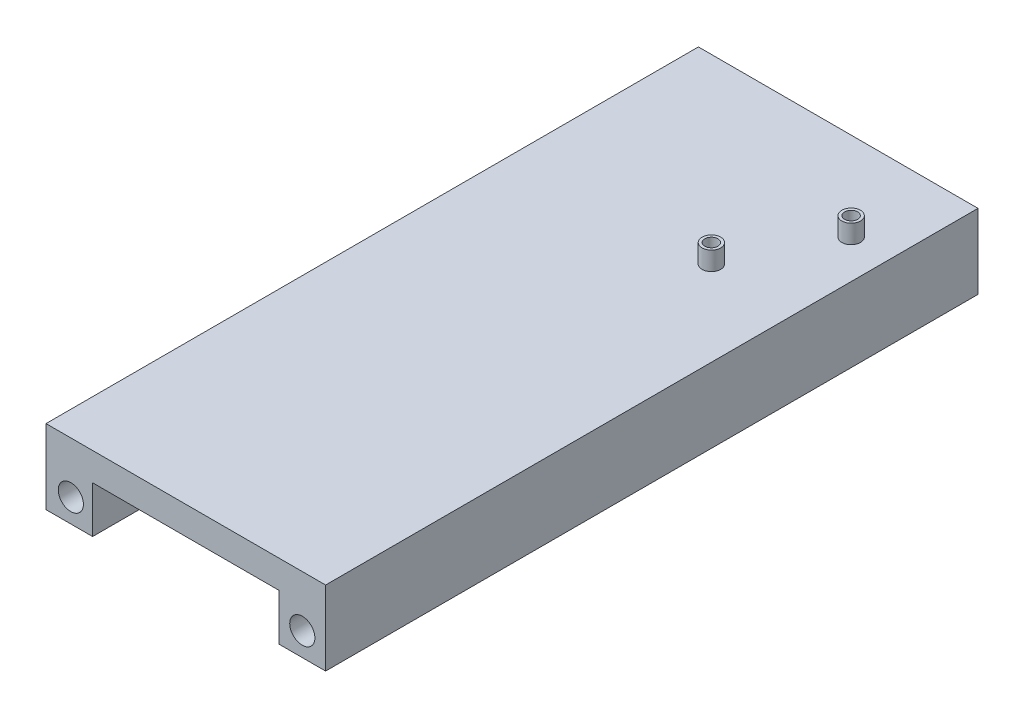
ISO-10303-21;
HEADER;
FILE_DESCRIPTION(('STEP AP214'),'2;1');
FILE_NAME('part.step','',(''),(''),'','','');
FILE_SCHEMA(('AUTOMOTIVE_DESIGN { 1 0 10303 214 1 1 1 1 }'));
ENDSEC;
DATA;
#1=APPLICATION_CONTEXT('core data for automotive mechanical design processes');
#2=APPLICATION_PROTOCOL_DEFINITION('international standard','automotive_design',2000,#1);
#3=PRODUCT_CONTEXT('',#1,'mechanical');
#4=PRODUCT('Part','Part','',(#3));
#5=PRODUCT_RELATED_PRODUCT_CATEGORY('part','',(#4));
#6=PRODUCT_DEFINITION_FORMATION('','',#4);
#7=PRODUCT_DEFINITION_CONTEXT('part definition',#1,'design');
#8=PRODUCT_DEFINITION('design','',#6,#7);
#9=PRODUCT_DEFINITION_SHAPE('','',#8);
#10=(LENGTH_UNIT() NAMED_UNIT(*) SI_UNIT(.MILLI.,.METRE.));
#11=(NAMED_UNIT(*) PLANE_ANGLE_UNIT() SI_UNIT($,.RADIAN.));
#12=(NAMED_UNIT(*) SI_UNIT($,.STERADIAN.) SOLID_ANGLE_UNIT());
#13=UNCERTAINTY_MEASURE_WITH_UNIT(LENGTH_MEASURE(1.E-05),#10,'distance_accuracy_value','');
#14=(GEOMETRIC_REPRESENTATION_CONTEXT(3) GLOBAL_UNCERTAINTY_ASSIGNED_CONTEXT((#13)) GLOBAL_UNIT_ASSIGNED_CONTEXT((#10,
#11,#12)) REPRESENTATION_CONTEXT('',''));
#15=CARTESIAN_POINT('',(0.,0.,0.));
#16=DIRECTION('',(0.,0.,1.));
#17=DIRECTION('',(1.,0.,0.));
#18=AXIS2_PLACEMENT_3D('',#15,#16,#17);
#19=CARTESIAN_POINT('',(0.,0.,0.));
#20=DIRECTION('',(0.,-1.,0.));
#21=DIRECTION('',(0.,0.,-1.));
#22=AXIS2_PLACEMENT_3D('',#19,#20,#21);
#23=PLANE('',#22);
#24=DIRECTION('',(-1.,0.,0.));
#25=VECTOR('',#24,1.);
#26=CARTESIAN_POINT('',(0.,0.,-177.8));
#27=LINE('',#26,#25);
#28=CARTESIAN_POINT('',(63.5,0.,-177.8));
#29=VERTEX_POINT('',#28);
#30=CARTESIAN_POINT('',(12.7,0.,-177.8));
#31=VERTEX_POINT('',#30);
#32=EDGE_CURVE('E57',#29,#31,#27,.T.);
#33=ORIENTED_EDGE('',*,*,#32,.F.);
#34=DIRECTION('',(0.,0.,-1.));
#35=VECTOR('',#34,1.);
#36=CARTESIAN_POINT('',(63.5,0.,0.));
#37=LINE('',#36,#35);
#38=CARTESIAN_POINT('',(63.5,0.,0.));
#39=VERTEX_POINT('',#38);
#40=EDGE_CURVE('E106',#39,#29,#37,.T.);
#41=ORIENTED_EDGE('',*,*,#40,.F.);
#42=DIRECTION('',(1.,0.,0.));
#43=VECTOR('',#42,1.);
#44=CARTESIAN_POINT('',(0.,0.,0.));
#45=LINE('',#44,#43);
#46=CARTESIAN_POINT('',(12.7,0.,0.));
#47=VERTEX_POINT('',#46);
#48=EDGE_CURVE('E114',#47,#39,#45,.T.);
#49=ORIENTED_EDGE('',*,*,#48,.F.);
#50=DIRECTION('',(0.,0.,1.));
#51=VECTOR('',#50,1.);
#52=CARTESIAN_POINT('',(12.7,0.,0.));
#53=LINE('',#52,#51);
#54=EDGE_CURVE('E116',#31,#47,#53,.T.);
#55=ORIENTED_EDGE('',*,*,#54,.F.);
#56=EDGE_LOOP('',(#33,#41,#49,#55));
#57=FACE_BOUND('',#56,.T.);
#58=ADVANCED_FACE('F37',(#57),#23,.T.);
#59=CARTESIAN_POINT('',(0.,7.62,0.));
#60=DIRECTION('',(1.,0.,0.));
#61=DIRECTION('',(0.,0.,-1.));
#62=AXIS2_PLACEMENT_3D('',#59,#60,#61);
#63=PLANE('',#62);
#64=DIRECTION('',(0.,-1.,0.));
#65=VECTOR('',#64,1.);
#66=CARTESIAN_POINT('',(0.,7.62,-177.8));
#67=LINE('',#66,#65);
#68=CARTESIAN_POINT('',(0.,7.62,-177.8));
#69=VERTEX_POINT('',#68);
#70=CARTESIAN_POINT('',(0.,-12.7,-177.8));
#71=VERTEX_POINT('',#70);
#72=EDGE_CURVE('E134',#69,#71,#67,.T.);
#73=ORIENTED_EDGE('',*,*,#72,.T.);
#74=DIRECTION('',(0.,0.,-1.));
#75=VECTOR('',#74,1.);
#76=CARTESIAN_POINT('',(0.,-12.7,0.));
#77=LINE('',#76,#75);
#78=CARTESIAN_POINT('',(0.,-12.7,0.));
#79=VERTEX_POINT('',#78);
#80=EDGE_CURVE('E166',#79,#71,#77,.T.);
#81=ORIENTED_EDGE('',*,*,#80,.F.);
#82=DIRECTION('',(0.,-1.,0.));
#83=VECTOR('',#82,1.);
#84=CARTESIAN_POINT('',(0.,7.62,0.));
#85=LINE('',#84,#83);
#86=CARTESIAN_POINT('',(0.,7.62,0.));
#87=VERTEX_POINT('',#86);
#88=EDGE_CURVE('E140',#87,#79,#85,.T.);
#89=ORIENTED_EDGE('',*,*,#88,.F.);
#90=DIRECTION('',(0.,0.,1.));
#91=VECTOR('',#90,1.);
#92=CARTESIAN_POINT('',(0.,7.62,0.));
#93=LINE('',#92,#91);
#94=EDGE_CURVE('E126',#69,#87,#93,.T.);
#95=ORIENTED_EDGE('',*,*,#94,.F.);
#96=EDGE_LOOP('',(#73,#81,#89,#95));
#97=FACE_BOUND('',#96,.T.);
#98=ADVANCED_FACE('F39',(#97),#63,.F.);
#99=CARTESIAN_POINT('',(0.,7.62,0.));
#100=DIRECTION('',(0.,0.,-1.));
#101=DIRECTION('',(-1.,0.,0.));
#102=AXIS2_PLACEMENT_3D('',#99,#100,#101);
#103=PLANE('',#102);
#104=CARTESIAN_POINT('',(69.8500000000001,-6.35,0.));
#105=DIRECTION('',(0.,0.,-1.));
#106=DIRECTION('',(-1.,0.,0.));
#107=AXIS2_PLACEMENT_3D('',#104,#105,#106);
#108=CIRCLE('',#107,3.429);
#109=CARTESIAN_POINT('',(66.421,-6.35,0.));
#110=VERTEX_POINT('',#109);
#111=EDGE_CURVE('E111',#110,#110,#108,.T.);
#112=ORIENTED_EDGE('',*,*,#111,.T.);
#113=EDGE_LOOP('',(#112));
#114=FACE_BOUND('',#113,.T.);
#115=CARTESIAN_POINT('',(6.77235180642571,-6.35,0.));
#116=DIRECTION('',(0.,0.,-1.));
#117=DIRECTION('',(-1.,0.,0.));
#118=AXIS2_PLACEMENT_3D('',#115,#116,#117);
#119=CIRCLE('',#118,3.429);
#120=CARTESIAN_POINT('',(3.34335180642571,-6.35,0.));
#121=VERTEX_POINT('',#120);
#122=EDGE_CURVE('E198',#121,#121,#119,.T.);
#123=ORIENTED_EDGE('',*,*,#122,.T.);
#124=EDGE_LOOP('',(#123));
#125=FACE_BOUND('',#124,.T.);
#126=ORIENTED_EDGE('',*,*,#88,.T.);
#127=DIRECTION('',(-1.,0.,0.));
#128=VECTOR('',#127,1.);
#129=CARTESIAN_POINT('',(0.,-12.7,0.));
#130=LINE('',#129,#128);
#131=CARTESIAN_POINT('',(12.7,-12.7,0.));
#132=VERTEX_POINT('',#131);
#133=EDGE_CURVE('E168',#132,#79,#130,.T.);
#134=ORIENTED_EDGE('',*,*,#133,.F.);
#135=DIRECTION('',(0.,1.,0.));
#136=VECTOR('',#135,1.);
#137=CARTESIAN_POINT('',(12.7,-12.7,0.));
#138=LINE('',#137,#136);
#139=EDGE_CURVE('E123',#132,#47,#138,.T.);
#140=ORIENTED_EDGE('',*,*,#139,.T.);
#141=ORIENTED_EDGE('',*,*,#48,.T.);
#142=DIRECTION('',(0.,1.,0.));
#143=VECTOR('',#142,1.);
#144=CARTESIAN_POINT('',(63.5,-12.7,0.));
#145=LINE('',#144,#143);
#146=CARTESIAN_POINT('',(63.5,-12.7,0.));
#147=VERTEX_POINT('',#146);
#148=EDGE_CURVE('E103',#147,#39,#145,.T.);
#149=ORIENTED_EDGE('',*,*,#148,.F.);
#150=DIRECTION('',(-1.,0.,0.));
#151=VECTOR('',#150,1.);
#152=CARTESIAN_POINT('',(76.2,-12.7,0.));
#153=LINE('',#152,#151);
#154=CARTESIAN_POINT('',(76.2,-12.7,0.));
#155=VERTEX_POINT('',#154);
#156=EDGE_CURVE('E192',#155,#147,#153,.T.);
#157=ORIENTED_EDGE('',*,*,#156,.F.);
#158=DIRECTION('',(0.,-1.,0.));
#159=VECTOR('',#158,1.);
#160=CARTESIAN_POINT('',(76.2,7.62,0.));
#161=LINE('',#160,#159);
#162=CARTESIAN_POINT('',(76.2,7.62,0.));
#163=VERTEX_POINT('',#162);
#164=EDGE_CURVE('E138',#163,#155,#161,.T.);
#165=ORIENTED_EDGE('',*,*,#164,.F.);
#166=DIRECTION('',(1.,0.,0.));
#167=VECTOR('',#166,1.);
#168=CARTESIAN_POINT('',(0.,7.62,0.));
#169=LINE('',#168,#167);
#170=EDGE_CURVE('E158',#87,#163,#169,.T.);
#171=ORIENTED_EDGE('',*,*,#170,.F.);
#172=EDGE_LOOP('',(#126,#134,#140,#141,#149,#157,#165,#171));
#173=FACE_BOUND('',#172,.T.);
#174=ADVANCED_FACE('F120',(#114,#125,#173),#103,.F.);
#175=CARTESIAN_POINT('',(76.2,7.62,0.));
#176=DIRECTION('',(-1.,0.,0.));
#177=DIRECTION('',(0.,0.,1.));
#178=AXIS2_PLACEMENT_3D('',#175,#176,#177);
#179=PLANE('',#178);
#180=ORIENTED_EDGE('',*,*,#164,.T.);
#181=DIRECTION('',(0.,0.,1.));
#182=VECTOR('',#181,1.);
#183=CARTESIAN_POINT('',(76.2,-12.7,0.));
#184=LINE('',#183,#182);
#185=CARTESIAN_POINT('',(76.2,-12.7,-177.8));
#186=VERTEX_POINT('',#185);
#187=EDGE_CURVE('E117',#186,#155,#184,.T.);
#188=ORIENTED_EDGE('',*,*,#187,.F.);
#189=DIRECTION('',(0.,-1.,0.));
#190=VECTOR('',#189,1.);
#191=CARTESIAN_POINT('',(76.2,7.62,-177.8));
#192=LINE('',#191,#190);
#193=CARTESIAN_POINT('',(76.2,7.62,-177.8));
#194=VERTEX_POINT('',#193);
#195=EDGE_CURVE('E136',#194,#186,#192,.T.);
#196=ORIENTED_EDGE('',*,*,#195,.F.);
#197=DIRECTION('',(0.,0.,-1.));
#198=VECTOR('',#197,1.);
#199=CARTESIAN_POINT('',(76.2,7.62,0.));
#200=LINE('',#199,#198);
#201=EDGE_CURVE('E180',#163,#194,#200,.T.);
#202=ORIENTED_EDGE('',*,*,#201,.F.);
#203=EDGE_LOOP('',(#180,#188,#196,#202));
#204=FACE_BOUND('',#203,.T.);
#205=ADVANCED_FACE('F185',(#204),#179,.F.);
#206=CARTESIAN_POINT('',(0.,7.62,-177.8));
#207=DIRECTION('',(0.,0.,1.));
#208=DIRECTION('',(1.,0.,0.));
#209=AXIS2_PLACEMENT_3D('',#206,#207,#208);
#210=PLANE('',#209);
#211=CARTESIAN_POINT('',(69.8500000000001,-6.35,-177.8));
#212=DIRECTION('',(0.,0.,-1.));
#213=DIRECTION('',(-1.,0.,0.));
#214=AXIS2_PLACEMENT_3D('',#211,#212,#213);
#215=CIRCLE('',#214,3.429);
#216=CARTESIAN_POINT('',(66.421,-6.35,-177.8));
#217=VERTEX_POINT('',#216);
#218=EDGE_CURVE('E205',#217,#217,#215,.T.);
#219=ORIENTED_EDGE('',*,*,#218,.F.);
#220=EDGE_LOOP('',(#219));
#221=FACE_BOUND('',#220,.T.);
#222=CARTESIAN_POINT('',(6.77235180642571,-6.35,-177.8));
#223=DIRECTION('',(0.,0.,-1.));
#224=DIRECTION('',(-1.,0.,0.));
#225=AXIS2_PLACEMENT_3D('',#222,#223,#224);
#226=CIRCLE('',#225,3.429);
#227=CARTESIAN_POINT('',(3.34335180642571,-6.35,-177.8));
#228=VERTEX_POINT('',#227);
#229=EDGE_CURVE('E201',#228,#228,#226,.T.);
#230=ORIENTED_EDGE('',*,*,#229,.F.);
#231=EDGE_LOOP('',(#230));
#232=FACE_BOUND('',#231,.T.);
#233=ORIENTED_EDGE('',*,*,#195,.T.);
#234=DIRECTION('',(1.,0.,0.));
#235=VECTOR('',#234,1.);
#236=CARTESIAN_POINT('',(76.2,-12.7,-177.8));
#237=LINE('',#236,#235);
#238=CARTESIAN_POINT('',(63.5000000000001,-12.7,-177.8));
#239=VERTEX_POINT('',#238);
#240=EDGE_CURVE('E195',#239,#186,#237,.T.);
#241=ORIENTED_EDGE('',*,*,#240,.F.);
#242=DIRECTION('',(0.,1.,0.));
#243=VECTOR('',#242,1.);
#244=CARTESIAN_POINT('',(63.5000000000001,-12.7,-177.8));
#245=LINE('',#244,#243);
#246=EDGE_CURVE('E52',#239,#29,#245,.T.);
#247=ORIENTED_EDGE('',*,*,#246,.T.);
#248=ORIENTED_EDGE('',*,*,#32,.T.);
#249=DIRECTION('',(0.,1.,0.));
#250=VECTOR('',#249,1.);
#251=CARTESIAN_POINT('',(12.7,-12.7,-177.8));
#252=LINE('',#251,#250);
#253=CARTESIAN_POINT('',(12.7,-12.7,-177.8));
#254=VERTEX_POINT('',#253);
#255=EDGE_CURVE('E124',#254,#31,#252,.T.);
#256=ORIENTED_EDGE('',*,*,#255,.F.);
#257=DIRECTION('',(1.,0.,0.));
#258=VECTOR('',#257,1.);
#259=CARTESIAN_POINT('',(0.,-12.7,-177.8));
#260=LINE('',#259,#258);
#261=EDGE_CURVE('E175',#71,#254,#260,.T.);
#262=ORIENTED_EDGE('',*,*,#261,.F.);
#263=ORIENTED_EDGE('',*,*,#72,.F.);
#264=DIRECTION('',(-1.,0.,0.));
#265=VECTOR('',#264,1.);
#266=CARTESIAN_POINT('',(0.,7.62,-177.8));
#267=LINE('',#266,#265);
#268=EDGE_CURVE('E131',#194,#69,#267,.T.);
#269=ORIENTED_EDGE('',*,*,#268,.F.);
#270=EDGE_LOOP('',(#233,#241,#247,#248,#256,#262,#263,#269));
#271=FACE_BOUND('',#270,.T.);
#272=ADVANCED_FACE('F150',(#221,#232,#271),#210,.F.);
#273=CARTESIAN_POINT('',(0.,7.62,0.));
#274=DIRECTION('',(0.,-1.,0.));
#275=DIRECTION('',(0.,0.,-1.));
#276=AXIS2_PLACEMENT_3D('',#273,#274,#275);
#277=PLANE('',#276);
#278=CARTESIAN_POINT('',(65.7098,7.62,-153.7208));
#279=DIRECTION('',(0.,-1.,0.));
#280=DIRECTION('',(0.,0.,-1.));
#281=AXIS2_PLACEMENT_3D('',#278,#279,#280);
#282=CIRCLE('',#281,2.54);
#283=CARTESIAN_POINT('',(65.7098,7.62,-156.2608));
#284=VERTEX_POINT('',#283);
#285=EDGE_CURVE('E11',#284,#284,#282,.F.);
#286=ORIENTED_EDGE('',*,*,#285,.F.);
#287=EDGE_LOOP('',(#286));
#288=FACE_BOUND('',#287,.T.);
#289=CARTESIAN_POINT('',(53.0098,7.62,-128.3208));
#290=DIRECTION('',(0.,-1.,0.));
#291=DIRECTION('',(0.,0.,-1.));
#292=AXIS2_PLACEMENT_3D('',#289,#290,#291);
#293=CIRCLE('',#292,2.54000000000002);
#294=CARTESIAN_POINT('',(53.0098,7.62,-130.8608));
#295=VERTEX_POINT('',#294);
#296=EDGE_CURVE('E45',#295,#295,#293,.F.);
#297=ORIENTED_EDGE('',*,*,#296,.F.);
#298=EDGE_LOOP('',(#297));
#299=FACE_BOUND('',#298,.T.);
#300=ORIENTED_EDGE('',*,*,#94,.T.);
#301=ORIENTED_EDGE('',*,*,#170,.T.);
#302=ORIENTED_EDGE('',*,*,#201,.T.);
#303=ORIENTED_EDGE('',*,*,#268,.T.);
#304=EDGE_LOOP('',(#300,#301,#302,#303));
#305=FACE_BOUND('',#304,.T.);
#306=ADVANCED_FACE('F146',(#288,#299,#305),#277,.F.);
#307=CARTESIAN_POINT('',(12.7,-12.7,0.));
#308=DIRECTION('',(-1.,0.,0.));
#309=DIRECTION('',(0.,0.,1.));
#310=AXIS2_PLACEMENT_3D('',#307,#308,#309);
#311=PLANE('',#310);
#312=ORIENTED_EDGE('',*,*,#54,.T.);
#313=ORIENTED_EDGE('',*,*,#139,.F.);
#314=DIRECTION('',(0.,0.,1.));
#315=VECTOR('',#314,1.);
#316=CARTESIAN_POINT('',(12.7,-12.7,0.));
#317=LINE('',#316,#315);
#318=EDGE_CURVE('E172',#254,#132,#317,.T.);
#319=ORIENTED_EDGE('',*,*,#318,.F.);
#320=ORIENTED_EDGE('',*,*,#255,.T.);
#321=EDGE_LOOP('',(#312,#313,#319,#320));
#322=FACE_BOUND('',#321,.T.);
#323=ADVANCED_FACE('F149',(#322),#311,.F.);
#324=CARTESIAN_POINT('',(0.,-12.7,0.));
#325=DIRECTION('',(0.,-1.,0.));
#326=DIRECTION('',(0.,0.,-1.));
#327=AXIS2_PLACEMENT_3D('',#324,#325,#326);
#328=PLANE('',#327);
#329=ORIENTED_EDGE('',*,*,#80,.T.);
#330=ORIENTED_EDGE('',*,*,#261,.T.);
#331=ORIENTED_EDGE('',*,*,#318,.T.);
#332=ORIENTED_EDGE('',*,*,#133,.T.);
#333=EDGE_LOOP('',(#329,#330,#331,#332));
#334=FACE_BOUND('',#333,.T.);
#335=ADVANCED_FACE('F170',(#334),#328,.T.);
#336=CARTESIAN_POINT('',(63.5,-12.7,0.));
#337=DIRECTION('',(1.,0.,0.));
#338=DIRECTION('',(0.,0.,-1.));
#339=AXIS2_PLACEMENT_3D('',#336,#337,#338);
#340=PLANE('',#339);
#341=ORIENTED_EDGE('',*,*,#40,.T.);
#342=ORIENTED_EDGE('',*,*,#246,.F.);
#343=DIRECTION('',(0.,0.,-1.));
#344=VECTOR('',#343,1.);
#345=CARTESIAN_POINT('',(63.5,-12.7,0.));
#346=LINE('',#345,#344);
#347=EDGE_CURVE('E107',#147,#239,#346,.T.);
#348=ORIENTED_EDGE('',*,*,#347,.F.);
#349=ORIENTED_EDGE('',*,*,#148,.T.);
#350=EDGE_LOOP('',(#341,#342,#348,#349));
#351=FACE_BOUND('',#350,.T.);
#352=ADVANCED_FACE('F105',(#351),#340,.F.);
#353=CARTESIAN_POINT('',(0.,-12.7,0.));
#354=DIRECTION('',(0.,1.,0.));
#355=DIRECTION('',(0.,0.,1.));
#356=AXIS2_PLACEMENT_3D('',#353,#354,#355);
#357=PLANE('',#356);
#358=ORIENTED_EDGE('',*,*,#187,.T.);
#359=ORIENTED_EDGE('',*,*,#156,.T.);
#360=ORIENTED_EDGE('',*,*,#347,.T.);
#361=ORIENTED_EDGE('',*,*,#240,.T.);
#362=EDGE_LOOP('',(#358,#359,#360,#361));
#363=FACE_BOUND('',#362,.T.);
#364=ADVANCED_FACE('F269',(#363),#357,.F.);
#365=CARTESIAN_POINT('',(6.77235180642571,-6.35,0.));
#366=DIRECTION('',(0.,0.,-1.));
#367=DIRECTION('',(-1.,0.,0.));
#368=AXIS2_PLACEMENT_3D('',#365,#366,#367);
#369=CYLINDRICAL_SURFACE('',#368,3.429);
#370=ORIENTED_EDGE('',*,*,#122,.F.);
#371=EDGE_LOOP('',(#370));
#372=FACE_BOUND('',#371,.T.);
#373=ORIENTED_EDGE('',*,*,#229,.T.);
#374=EDGE_LOOP('',(#373));
#375=FACE_BOUND('',#374,.T.);
#376=ADVANCED_FACE('F265',(#372,#375),#369,.F.);
#377=CARTESIAN_POINT('',(69.8500000000001,-6.35,0.));
#378=DIRECTION('',(0.,0.,-1.));
#379=DIRECTION('',(-1.,0.,0.));
#380=AXIS2_PLACEMENT_3D('',#377,#378,#379);
#381=CYLINDRICAL_SURFACE('',#380,3.429);
#382=ORIENTED_EDGE('',*,*,#111,.F.);
#383=EDGE_LOOP('',(#382));
#384=FACE_BOUND('',#383,.T.);
#385=ORIENTED_EDGE('',*,*,#218,.T.);
#386=EDGE_LOOP('',(#385));
#387=FACE_BOUND('',#386,.T.);
#388=ADVANCED_FACE('F268',(#384,#387),#381,.F.);
#389=CARTESIAN_POINT('',(53.0098,12.7,-128.3208));
#390=DIRECTION('',(0.,-1.,0.));
#391=DIRECTION('',(0.,0.,-1.));
#392=AXIS2_PLACEMENT_3D('',#389,#390,#391);
#393=CYLINDRICAL_SURFACE('',#392,1.77799999999999);
#394=CARTESIAN_POINT('',(53.0098,12.7,-128.3208));
#395=DIRECTION('',(0.,1.,0.));
#396=DIRECTION('',(0.,0.,1.));
#397=AXIS2_PLACEMENT_3D('',#394,#395,#396);
#398=CIRCLE('',#397,1.77799999999999);
#399=CARTESIAN_POINT('',(53.0098,12.7,-126.5428));
#400=VERTEX_POINT('',#399);
#401=EDGE_CURVE('E213',#400,#400,#398,.T.);
#402=ORIENTED_EDGE('',*,*,#401,.T.);
#403=EDGE_LOOP('',(#402));
#404=FACE_BOUND('',#403,.T.);
#405=CARTESIAN_POINT('',(53.0098,7.62,-128.3208));
#406=DIRECTION('',(0.,1.,0.));
#407=DIRECTION('',(0.,0.,1.));
#408=AXIS2_PLACEMENT_3D('',#405,#406,#407);
#409=CIRCLE('',#408,1.77799999999999);
#410=CARTESIAN_POINT('',(53.0098,7.62,-126.5428));
#411=VERTEX_POINT('',#410);
#412=EDGE_CURVE('E210',#411,#411,#409,.T.);
#413=ORIENTED_EDGE('',*,*,#412,.F.);
#414=EDGE_LOOP('',(#413));
#415=FACE_BOUND('',#414,.T.);
#416=ADVANCED_FACE('F277',(#404,#415),#393,.F.);
#417=CARTESIAN_POINT('',(53.0098,12.7,-128.3208));
#418=DIRECTION('',(0.,-1.,0.));
#419=DIRECTION('',(0.,0.,-1.));
#420=AXIS2_PLACEMENT_3D('',#417,#418,#419);
#421=CYLINDRICAL_SURFACE('',#420,2.54000000000002);
#422=CARTESIAN_POINT('',(53.0098,12.7,-128.3208));
#423=DIRECTION('',(0.,1.,0.));
#424=DIRECTION('',(0.,0.,1.));
#425=AXIS2_PLACEMENT_3D('',#422,#423,#424);
#426=CIRCLE('',#425,2.54000000000002);
#427=CARTESIAN_POINT('',(53.0098,12.7,-125.7808));
#428=VERTEX_POINT('',#427);
#429=EDGE_CURVE('E202',#428,#428,#426,.T.);
#430=ORIENTED_EDGE('',*,*,#429,.F.);
#431=EDGE_LOOP('',(#430));
#432=FACE_BOUND('',#431,.T.);
#433=ORIENTED_EDGE('',*,*,#296,.T.);
#434=EDGE_LOOP('',(#433));
#435=FACE_BOUND('',#434,.T.);
#436=ADVANCED_FACE('F144',(#432,#435),#421,.T.);
#437=CARTESIAN_POINT('',(0.,12.7,0.));
#438=DIRECTION('',(0.,1.,0.));
#439=DIRECTION('',(0.,0.,1.));
#440=AXIS2_PLACEMENT_3D('',#437,#438,#439);
#441=PLANE('',#440);
#442=ORIENTED_EDGE('',*,*,#401,.F.);
#443=EDGE_LOOP('',(#442));
#444=FACE_BOUND('',#443,.T.);
#445=ORIENTED_EDGE('',*,*,#429,.T.);
#446=EDGE_LOOP('',(#445));
#447=FACE_BOUND('',#446,.T.);
#448=ADVANCED_FACE('F356',(#444,#447),#441,.T.);
#449=ORIENTED_EDGE('',*,*,#412,.T.);
#450=EDGE_LOOP('',(#449));
#451=FACE_BOUND('',#450,.T.);
#452=ADVANCED_FACE('F154',(#451),#277,.F.);
#453=CARTESIAN_POINT('',(65.7098,12.7,-153.7208));
#454=DIRECTION('',(0.,-1.,0.));
#455=DIRECTION('',(0.,0.,-1.));
#456=AXIS2_PLACEMENT_3D('',#453,#454,#455);
#457=CYLINDRICAL_SURFACE('',#456,1.778);
#458=CARTESIAN_POINT('',(65.7098,12.7,-153.7208));
#459=DIRECTION('',(0.,1.,0.));
#460=DIRECTION('',(0.,0.,1.));
#461=AXIS2_PLACEMENT_3D('',#458,#459,#460);
#462=CIRCLE('',#461,1.778);
#463=CARTESIAN_POINT('',(65.7098,12.7,-151.9428));
#464=VERTEX_POINT('',#463);
#465=EDGE_CURVE('E222',#464,#464,#462,.T.);
#466=ORIENTED_EDGE('',*,*,#465,.T.);
#467=EDGE_LOOP('',(#466));
#468=FACE_BOUND('',#467,.T.);
#469=CARTESIAN_POINT('',(65.7098,7.62,-153.7208));
#470=DIRECTION('',(0.,1.,0.));
#471=DIRECTION('',(0.,0.,1.));
#472=AXIS2_PLACEMENT_3D('',#469,#470,#471);
#473=CIRCLE('',#472,1.778);
#474=CARTESIAN_POINT('',(65.7098,7.62,-151.9428));
#475=VERTEX_POINT('',#474);
#476=EDGE_CURVE('E219',#475,#475,#473,.T.);
#477=ORIENTED_EDGE('',*,*,#476,.F.);
#478=EDGE_LOOP('',(#477));
#479=FACE_BOUND('',#478,.T.);
#480=ADVANCED_FACE('F228',(#468,#479),#457,.F.);
#481=CARTESIAN_POINT('',(65.7098,12.7,-153.7208));
#482=DIRECTION('',(0.,-1.,0.));
#483=DIRECTION('',(0.,0.,-1.));
#484=AXIS2_PLACEMENT_3D('',#481,#482,#483);
#485=CYLINDRICAL_SURFACE('',#484,2.54);
#486=CARTESIAN_POINT('',(65.7098,12.7,-153.7208));
#487=DIRECTION('',(0.,1.,0.));
#488=DIRECTION('',(0.,0.,1.));
#489=AXIS2_PLACEMENT_3D('',#486,#487,#488);
#490=CIRCLE('',#489,2.54);
#491=CARTESIAN_POINT('',(65.7098,12.7,-151.1808));
#492=VERTEX_POINT('',#491);
#493=EDGE_CURVE('E214',#492,#492,#490,.T.);
#494=ORIENTED_EDGE('',*,*,#493,.F.);
#495=EDGE_LOOP('',(#494));
#496=FACE_BOUND('',#495,.T.);
#497=ORIENTED_EDGE('',*,*,#285,.T.);
#498=EDGE_LOOP('',(#497));
#499=FACE_BOUND('',#498,.T.);
#500=ADVANCED_FACE('F234',(#496,#499),#485,.T.);
#501=CARTESIAN_POINT('',(0.,12.7,0.));
#502=DIRECTION('',(0.,1.,0.));
#503=DIRECTION('',(0.,0.,1.));
#504=AXIS2_PLACEMENT_3D('',#501,#502,#503);
#505=PLANE('',#504);
#506=ORIENTED_EDGE('',*,*,#465,.F.);
#507=EDGE_LOOP('',(#506));
#508=FACE_BOUND('',#507,.T.);
#509=ORIENTED_EDGE('',*,*,#493,.T.);
#510=EDGE_LOOP('',(#509));
#511=FACE_BOUND('',#510,.T.);
#512=ADVANCED_FACE('F231',(#508,#511),#505,.T.);
#513=ORIENTED_EDGE('',*,*,#476,.T.);
#514=EDGE_LOOP('',(#513));
#515=FACE_BOUND('',#514,.T.);
#516=ADVANCED_FACE('F153',(#515),#277,.F.);
#517=CLOSED_SHELL('',(#58,#98,#174,#205,#272,#306,#323,#335,#352,#364,#376,#388,#416,#436,#448,
#452,#480,#500,#512,#516));
#518=MANIFOLD_SOLID_BREP('B2',#517);
#519=ADVANCED_BREP_SHAPE_REPRESENTATION('',(#18,#518),#14);
#520=SHAPE_DEFINITION_REPRESENTATION(#9,#519);
ENDSEC;
END-ISO-10303-21;
